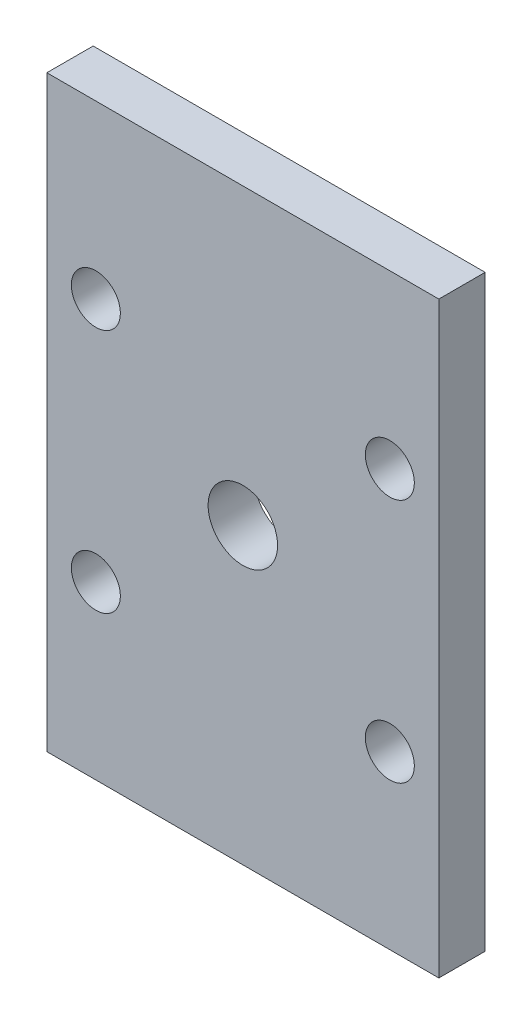
ISO-10303-21;
HEADER;
FILE_DESCRIPTION(('STEP AP214'),'2;1');
FILE_NAME('part.step','',(''),(''),'','','');
FILE_SCHEMA(('AUTOMOTIVE_DESIGN { 1 0 10303 214 1 1 1 1 }'));
ENDSEC;
DATA;
#1=APPLICATION_CONTEXT('core data for automotive mechanical design processes');
#2=APPLICATION_PROTOCOL_DEFINITION('international standard','automotive_design',2000,#1);
#3=PRODUCT_CONTEXT('',#1,'mechanical');
#4=PRODUCT('Part','Part','',(#3));
#5=PRODUCT_RELATED_PRODUCT_CATEGORY('part','',(#4));
#6=PRODUCT_DEFINITION_FORMATION('','',#4);
#7=PRODUCT_DEFINITION_CONTEXT('part definition',#1,'design');
#8=PRODUCT_DEFINITION('design','',#6,#7);
#9=PRODUCT_DEFINITION_SHAPE('','',#8);
#10=(LENGTH_UNIT() NAMED_UNIT(*) SI_UNIT(.MILLI.,.METRE.));
#11=(NAMED_UNIT(*) PLANE_ANGLE_UNIT() SI_UNIT($,.RADIAN.));
#12=(NAMED_UNIT(*) SI_UNIT($,.STERADIAN.) SOLID_ANGLE_UNIT());
#13=UNCERTAINTY_MEASURE_WITH_UNIT(LENGTH_MEASURE(1.E-05),#10,'distance_accuracy_value','');
#14=(GEOMETRIC_REPRESENTATION_CONTEXT(3) GLOBAL_UNCERTAINTY_ASSIGNED_CONTEXT((#13)) GLOBAL_UNIT_ASSIGNED_CONTEXT((#10,
#11,#12)) REPRESENTATION_CONTEXT('',''));
#15=CARTESIAN_POINT('',(0.,0.,0.));
#16=DIRECTION('',(0.,0.,1.));
#17=DIRECTION('',(1.,0.,0.));
#18=AXIS2_PLACEMENT_3D('',#15,#16,#17);
#19=CARTESIAN_POINT('',(0.,0.,6.));
#20=DIRECTION('',(1.,0.,0.));
#21=DIRECTION('',(0.,0.,-1.));
#22=AXIS2_PLACEMENT_3D('',#19,#20,#21);
#23=PLANE('',#22);
#24=DIRECTION('',(0.,-1.,0.));
#25=VECTOR('',#24,1.);
#26=CARTESIAN_POINT('',(0.,0.,0.));
#27=LINE('',#26,#25);
#28=CARTESIAN_POINT('',(0.,76.2,0.));
#29=VERTEX_POINT('',#28);
#30=CARTESIAN_POINT('',(0.,0.,0.));
#31=VERTEX_POINT('',#30);
#32=EDGE_CURVE('E100',#29,#31,#27,.T.);
#33=ORIENTED_EDGE('',*,*,#32,.T.);
#34=DIRECTION('',(0.,0.,-1.));
#35=VECTOR('',#34,1.);
#36=CARTESIAN_POINT('',(0.,0.,6.));
#37=LINE('',#36,#35);
#38=CARTESIAN_POINT('',(0.,0.,6.));
#39=VERTEX_POINT('',#38);
#40=EDGE_CURVE('E11',#39,#31,#37,.T.);
#41=ORIENTED_EDGE('',*,*,#40,.F.);
#42=DIRECTION('',(0.,-1.,0.));
#43=VECTOR('',#42,1.);
#44=CARTESIAN_POINT('',(0.,0.,6.));
#45=LINE('',#44,#43);
#46=CARTESIAN_POINT('',(0.,76.2,6.));
#47=VERTEX_POINT('',#46);
#48=EDGE_CURVE('E88',#47,#39,#45,.T.);
#49=ORIENTED_EDGE('',*,*,#48,.F.);
#50=DIRECTION('',(0.,0.,-1.));
#51=VECTOR('',#50,1.);
#52=CARTESIAN_POINT('',(0.,76.2,6.));
#53=LINE('',#52,#51);
#54=EDGE_CURVE('E96',#47,#29,#53,.T.);
#55=ORIENTED_EDGE('',*,*,#54,.T.);
#56=EDGE_LOOP('',(#33,#41,#49,#55));
#57=FACE_BOUND('',#56,.T.);
#58=ADVANCED_FACE('F37',(#57),#23,.F.);
#59=CARTESIAN_POINT('',(0.,0.,6.));
#60=DIRECTION('',(0.,1.,0.));
#61=DIRECTION('',(0.,0.,1.));
#62=AXIS2_PLACEMENT_3D('',#59,#60,#61);
#63=PLANE('',#62);
#64=DIRECTION('',(1.,0.,0.));
#65=VECTOR('',#64,1.);
#66=CARTESIAN_POINT('',(0.,0.,0.));
#67=LINE('',#66,#65);
#68=CARTESIAN_POINT('',(50.8,0.,0.));
#69=VERTEX_POINT('',#68);
#70=EDGE_CURVE('E92',#31,#69,#67,.T.);
#71=ORIENTED_EDGE('',*,*,#70,.T.);
#72=DIRECTION('',(0.,0.,-1.));
#73=VECTOR('',#72,1.);
#74=CARTESIAN_POINT('',(50.8,0.,6.));
#75=LINE('',#74,#73);
#76=CARTESIAN_POINT('',(50.8,0.,6.));
#77=VERTEX_POINT('',#76);
#78=EDGE_CURVE('E45',#77,#69,#75,.T.);
#79=ORIENTED_EDGE('',*,*,#78,.F.);
#80=DIRECTION('',(1.,0.,0.));
#81=VECTOR('',#80,1.);
#82=CARTESIAN_POINT('',(0.,0.,6.));
#83=LINE('',#82,#81);
#84=EDGE_CURVE('E83',#39,#77,#83,.T.);
#85=ORIENTED_EDGE('',*,*,#84,.F.);
#86=ORIENTED_EDGE('',*,*,#40,.T.);
#87=EDGE_LOOP('',(#71,#79,#85,#86));
#88=FACE_BOUND('',#87,.T.);
#89=ADVANCED_FACE('F91',(#88),#63,.F.);
#90=CARTESIAN_POINT('',(50.8,0.,6.));
#91=DIRECTION('',(-1.,0.,0.));
#92=DIRECTION('',(0.,0.,1.));
#93=AXIS2_PLACEMENT_3D('',#90,#91,#92);
#94=PLANE('',#93);
#95=DIRECTION('',(0.,1.,0.));
#96=VECTOR('',#95,1.);
#97=CARTESIAN_POINT('',(50.8,0.,0.));
#98=LINE('',#97,#96);
#99=CARTESIAN_POINT('',(50.8,76.2,0.));
#100=VERTEX_POINT('',#99);
#101=EDGE_CURVE('E70',#69,#100,#98,.T.);
#102=ORIENTED_EDGE('',*,*,#101,.T.);
#103=DIRECTION('',(0.,0.,-1.));
#104=VECTOR('',#103,1.);
#105=CARTESIAN_POINT('',(50.8,76.2,6.));
#106=LINE('',#105,#104);
#107=CARTESIAN_POINT('',(50.8,76.2,6.));
#108=VERTEX_POINT('',#107);
#109=EDGE_CURVE('E93',#108,#100,#106,.T.);
#110=ORIENTED_EDGE('',*,*,#109,.F.);
#111=DIRECTION('',(0.,1.,0.));
#112=VECTOR('',#111,1.);
#113=CARTESIAN_POINT('',(50.8,0.,6.));
#114=LINE('',#113,#112);
#115=EDGE_CURVE('E86',#77,#108,#114,.T.);
#116=ORIENTED_EDGE('',*,*,#115,.F.);
#117=ORIENTED_EDGE('',*,*,#78,.T.);
#118=EDGE_LOOP('',(#102,#110,#116,#117));
#119=FACE_BOUND('',#118,.T.);
#120=ADVANCED_FACE('F94',(#119),#94,.F.);
#121=CARTESIAN_POINT('',(0.,76.2,6.));
#122=DIRECTION('',(0.,-1.,0.));
#123=DIRECTION('',(0.,0.,-1.));
#124=AXIS2_PLACEMENT_3D('',#121,#122,#123);
#125=PLANE('',#124);
#126=DIRECTION('',(-1.,0.,0.));
#127=VECTOR('',#126,1.);
#128=CARTESIAN_POINT('',(0.,76.2,0.));
#129=LINE('',#128,#127);
#130=EDGE_CURVE('E76',#100,#29,#129,.T.);
#131=ORIENTED_EDGE('',*,*,#130,.T.);
#132=ORIENTED_EDGE('',*,*,#54,.F.);
#133=DIRECTION('',(-1.,0.,0.));
#134=VECTOR('',#133,1.);
#135=CARTESIAN_POINT('',(0.,76.2,6.));
#136=LINE('',#135,#134);
#137=EDGE_CURVE('E53',#108,#47,#136,.T.);
#138=ORIENTED_EDGE('',*,*,#137,.F.);
#139=ORIENTED_EDGE('',*,*,#109,.T.);
#140=EDGE_LOOP('',(#131,#132,#138,#139));
#141=FACE_BOUND('',#140,.T.);
#142=ADVANCED_FACE('F108',(#141),#125,.F.);
#143=CARTESIAN_POINT('',(0.,0.,6.));
#144=DIRECTION('',(0.,0.,-1.));
#145=DIRECTION('',(-1.,0.,0.));
#146=AXIS2_PLACEMENT_3D('',#143,#144,#145);
#147=PLANE('',#146);
#148=CARTESIAN_POINT('',(25.4,38.1,6.));
#149=DIRECTION('',(0.,0.,1.));
#150=DIRECTION('',(1.,0.,0.));
#151=AXIS2_PLACEMENT_3D('',#148,#149,#150);
#152=CIRCLE('',#151,4.5);
#153=CARTESIAN_POINT('',(29.9,38.1,6.));
#154=VERTEX_POINT('',#153);
#155=EDGE_CURVE('E138',#154,#154,#152,.T.);
#156=ORIENTED_EDGE('',*,*,#155,.F.);
#157=EDGE_LOOP('',(#156));
#158=FACE_BOUND('',#157,.T.);
#159=CARTESIAN_POINT('',(44.45,53.975,6.));
#160=DIRECTION('',(0.,0.,1.));
#161=DIRECTION('',(1.,0.,0.));
#162=AXIS2_PLACEMENT_3D('',#159,#160,#161);
#163=CIRCLE('',#162,3.175);
#164=CARTESIAN_POINT('',(47.625,53.975,6.));
#165=VERTEX_POINT('',#164);
#166=EDGE_CURVE('E134',#165,#165,#163,.T.);
#167=ORIENTED_EDGE('',*,*,#166,.F.);
#168=EDGE_LOOP('',(#167));
#169=FACE_BOUND('',#168,.T.);
#170=CARTESIAN_POINT('',(6.34999999999999,53.975,6.));
#171=DIRECTION('',(0.,0.,1.));
#172=DIRECTION('',(1.,0.,0.));
#173=AXIS2_PLACEMENT_3D('',#170,#171,#172);
#174=CIRCLE('',#173,3.175);
#175=CARTESIAN_POINT('',(9.525,53.975,6.));
#176=VERTEX_POINT('',#175);
#177=EDGE_CURVE('E128',#176,#176,#174,.T.);
#178=ORIENTED_EDGE('',*,*,#177,.F.);
#179=EDGE_LOOP('',(#178));
#180=FACE_BOUND('',#179,.T.);
#181=CARTESIAN_POINT('',(6.34999999999999,22.225,6.));
#182=DIRECTION('',(0.,0.,1.));
#183=DIRECTION('',(1.,0.,0.));
#184=AXIS2_PLACEMENT_3D('',#181,#182,#183);
#185=CIRCLE('',#184,3.175);
#186=CARTESIAN_POINT('',(9.525,22.225,6.));
#187=VERTEX_POINT('',#186);
#188=EDGE_CURVE('E122',#187,#187,#185,.T.);
#189=ORIENTED_EDGE('',*,*,#188,.F.);
#190=EDGE_LOOP('',(#189));
#191=FACE_BOUND('',#190,.T.);
#192=CARTESIAN_POINT('',(44.45,22.225,6.));
#193=DIRECTION('',(0.,0.,1.));
#194=DIRECTION('',(1.,0.,0.));
#195=AXIS2_PLACEMENT_3D('',#192,#193,#194);
#196=CIRCLE('',#195,3.175);
#197=CARTESIAN_POINT('',(47.625,22.225,6.));
#198=VERTEX_POINT('',#197);
#199=EDGE_CURVE('E116',#198,#198,#196,.T.);
#200=ORIENTED_EDGE('',*,*,#199,.F.);
#201=EDGE_LOOP('',(#200));
#202=FACE_BOUND('',#201,.T.);
#203=ORIENTED_EDGE('',*,*,#48,.T.);
#204=ORIENTED_EDGE('',*,*,#84,.T.);
#205=ORIENTED_EDGE('',*,*,#115,.T.);
#206=ORIENTED_EDGE('',*,*,#137,.T.);
#207=EDGE_LOOP('',(#203,#204,#205,#206));
#208=FACE_BOUND('',#207,.T.);
#209=ADVANCED_FACE('F84',(#158,#169,#180,#191,#202,#208),#147,.F.);
#210=CARTESIAN_POINT('',(0.,0.,0.));
#211=DIRECTION('',(0.,0.,-1.));
#212=DIRECTION('',(-1.,0.,0.));
#213=AXIS2_PLACEMENT_3D('',#210,#211,#212);
#214=PLANE('',#213);
#215=CARTESIAN_POINT('',(25.4,38.1,0.));
#216=DIRECTION('',(0.,0.,1.));
#217=DIRECTION('',(1.,0.,0.));
#218=AXIS2_PLACEMENT_3D('',#215,#216,#217);
#219=CIRCLE('',#218,4.5);
#220=CARTESIAN_POINT('',(29.9,38.1,0.));
#221=VERTEX_POINT('',#220);
#222=EDGE_CURVE('E137',#221,#221,#219,.T.);
#223=ORIENTED_EDGE('',*,*,#222,.T.);
#224=EDGE_LOOP('',(#223));
#225=FACE_BOUND('',#224,.T.);
#226=CARTESIAN_POINT('',(44.45,53.975,0.));
#227=DIRECTION('',(0.,0.,1.));
#228=DIRECTION('',(1.,0.,0.));
#229=AXIS2_PLACEMENT_3D('',#226,#227,#228);
#230=CIRCLE('',#229,3.175);
#231=CARTESIAN_POINT('',(47.625,53.975,0.));
#232=VERTEX_POINT('',#231);
#233=EDGE_CURVE('E131',#232,#232,#230,.T.);
#234=ORIENTED_EDGE('',*,*,#233,.T.);
#235=EDGE_LOOP('',(#234));
#236=FACE_BOUND('',#235,.T.);
#237=CARTESIAN_POINT('',(6.34999999999999,53.975,0.));
#238=DIRECTION('',(0.,0.,1.));
#239=DIRECTION('',(1.,0.,0.));
#240=AXIS2_PLACEMENT_3D('',#237,#238,#239);
#241=CIRCLE('',#240,3.175);
#242=CARTESIAN_POINT('',(9.52499999999999,53.975,0.));
#243=VERTEX_POINT('',#242);
#244=EDGE_CURVE('E125',#243,#243,#241,.T.);
#245=ORIENTED_EDGE('',*,*,#244,.T.);
#246=EDGE_LOOP('',(#245));
#247=FACE_BOUND('',#246,.T.);
#248=CARTESIAN_POINT('',(6.34999999999999,22.225,0.));
#249=DIRECTION('',(0.,0.,1.));
#250=DIRECTION('',(1.,0.,0.));
#251=AXIS2_PLACEMENT_3D('',#248,#249,#250);
#252=CIRCLE('',#251,3.175);
#253=CARTESIAN_POINT('',(9.52499999999999,22.225,0.));
#254=VERTEX_POINT('',#253);
#255=EDGE_CURVE('E119',#254,#254,#252,.T.);
#256=ORIENTED_EDGE('',*,*,#255,.T.);
#257=EDGE_LOOP('',(#256));
#258=FACE_BOUND('',#257,.T.);
#259=CARTESIAN_POINT('',(44.45,22.225,0.));
#260=DIRECTION('',(0.,0.,1.));
#261=DIRECTION('',(1.,0.,0.));
#262=AXIS2_PLACEMENT_3D('',#259,#260,#261);
#263=CIRCLE('',#262,3.175);
#264=CARTESIAN_POINT('',(47.625,22.225,0.));
#265=VERTEX_POINT('',#264);
#266=EDGE_CURVE('E103',#265,#265,#263,.T.);
#267=ORIENTED_EDGE('',*,*,#266,.T.);
#268=EDGE_LOOP('',(#267));
#269=FACE_BOUND('',#268,.T.);
#270=ORIENTED_EDGE('',*,*,#32,.F.);
#271=ORIENTED_EDGE('',*,*,#130,.F.);
#272=ORIENTED_EDGE('',*,*,#101,.F.);
#273=ORIENTED_EDGE('',*,*,#70,.F.);
#274=EDGE_LOOP('',(#270,#271,#272,#273));
#275=FACE_BOUND('',#274,.T.);
#276=ADVANCED_FACE('F111',(#225,#236,#247,#258,#269,#275),#214,.T.);
#277=CARTESIAN_POINT('',(44.45,22.225,6.));
#278=DIRECTION('',(0.,0.,1.));
#279=DIRECTION('',(1.,0.,0.));
#280=AXIS2_PLACEMENT_3D('',#277,#278,#279);
#281=CYLINDRICAL_SURFACE('',#280,3.175);
#282=ORIENTED_EDGE('',*,*,#266,.F.);
#283=EDGE_LOOP('',(#282));
#284=FACE_BOUND('',#283,.T.);
#285=ORIENTED_EDGE('',*,*,#199,.T.);
#286=EDGE_LOOP('',(#285));
#287=FACE_BOUND('',#286,.T.);
#288=ADVANCED_FACE('F164',(#284,#287),#281,.F.);
#289=CARTESIAN_POINT('',(6.34999999999999,22.225,6.));
#290=DIRECTION('',(0.,0.,1.));
#291=DIRECTION('',(1.,0.,0.));
#292=AXIS2_PLACEMENT_3D('',#289,#290,#291);
#293=CYLINDRICAL_SURFACE('',#292,3.175);
#294=ORIENTED_EDGE('',*,*,#255,.F.);
#295=EDGE_LOOP('',(#294));
#296=FACE_BOUND('',#295,.T.);
#297=ORIENTED_EDGE('',*,*,#188,.T.);
#298=EDGE_LOOP('',(#297));
#299=FACE_BOUND('',#298,.T.);
#300=ADVANCED_FACE('F166',(#296,#299),#293,.F.);
#301=CARTESIAN_POINT('',(6.34999999999999,53.975,6.));
#302=DIRECTION('',(0.,0.,1.));
#303=DIRECTION('',(1.,0.,0.));
#304=AXIS2_PLACEMENT_3D('',#301,#302,#303);
#305=CYLINDRICAL_SURFACE('',#304,3.175);
#306=ORIENTED_EDGE('',*,*,#244,.F.);
#307=EDGE_LOOP('',(#306));
#308=FACE_BOUND('',#307,.T.);
#309=ORIENTED_EDGE('',*,*,#177,.T.);
#310=EDGE_LOOP('',(#309));
#311=FACE_BOUND('',#310,.T.);
#312=ADVANCED_FACE('F173',(#308,#311),#305,.F.);
#313=CARTESIAN_POINT('',(44.45,53.975,6.));
#314=DIRECTION('',(0.,0.,1.));
#315=DIRECTION('',(1.,0.,0.));
#316=AXIS2_PLACEMENT_3D('',#313,#314,#315);
#317=CYLINDRICAL_SURFACE('',#316,3.175);
#318=ORIENTED_EDGE('',*,*,#233,.F.);
#319=EDGE_LOOP('',(#318));
#320=FACE_BOUND('',#319,.T.);
#321=ORIENTED_EDGE('',*,*,#166,.T.);
#322=EDGE_LOOP('',(#321));
#323=FACE_BOUND('',#322,.T.);
#324=ADVANCED_FACE('F149',(#320,#323),#317,.F.);
#325=CARTESIAN_POINT('',(25.4,38.1,0.));
#326=DIRECTION('',(0.,0.,1.));
#327=DIRECTION('',(1.,0.,0.));
#328=AXIS2_PLACEMENT_3D('',#325,#326,#327);
#329=CYLINDRICAL_SURFACE('',#328,4.5);
#330=ORIENTED_EDGE('',*,*,#222,.F.);
#331=EDGE_LOOP('',(#330));
#332=FACE_BOUND('',#331,.T.);
#333=ORIENTED_EDGE('',*,*,#155,.T.);
#334=EDGE_LOOP('',(#333));
#335=FACE_BOUND('',#334,.T.);
#336=ADVANCED_FACE('F146',(#332,#335),#329,.F.);
#337=CLOSED_SHELL('',(#58,#89,#120,#142,#209,#276,#288,#300,#312,#324,#336));
#338=MANIFOLD_SOLID_BREP('B2',#337);
#339=ADVANCED_BREP_SHAPE_REPRESENTATION('',(#18,#338),#14);
#340=SHAPE_DEFINITION_REPRESENTATION(#9,#339);
ENDSEC;
END-ISO-10303-21;
